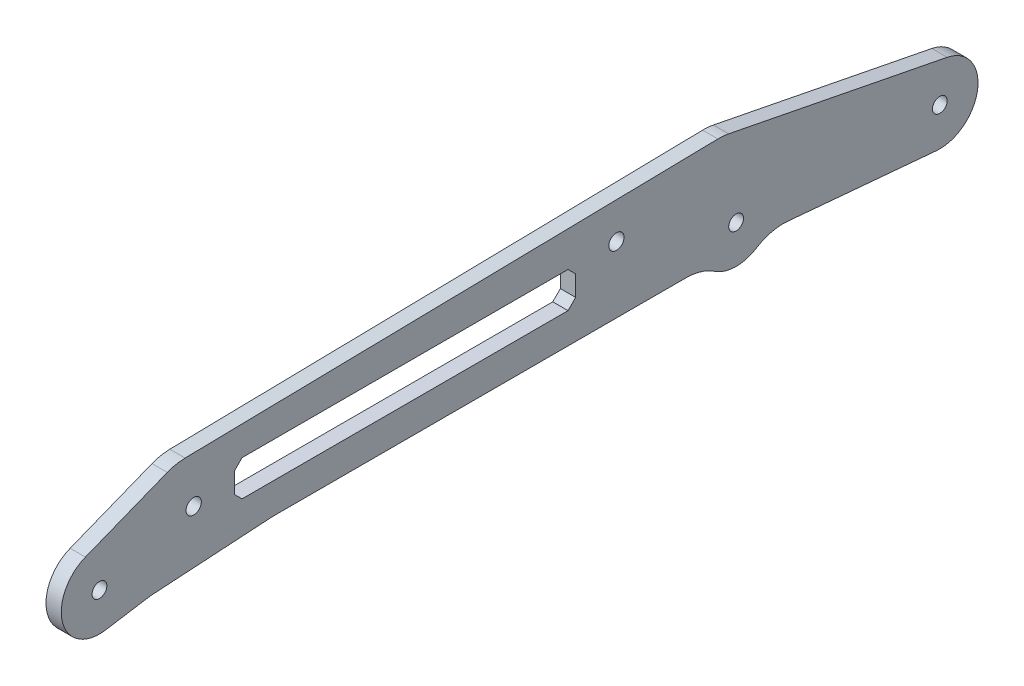
ISO-10303-21;
HEADER;
FILE_DESCRIPTION(('STEP AP214'),'2;1');
FILE_NAME('part.step','',(''),(''),'','','');
FILE_SCHEMA(('AUTOMOTIVE_DESIGN { 1 0 10303 214 1 1 1 1 }'));
ENDSEC;
DATA;
#1=APPLICATION_CONTEXT('core data for automotive mechanical design processes');
#2=APPLICATION_PROTOCOL_DEFINITION('international standard','automotive_design',2000,#1);
#3=PRODUCT_CONTEXT('',#1,'mechanical');
#4=PRODUCT('Part','Part','',(#3));
#5=PRODUCT_RELATED_PRODUCT_CATEGORY('part','',(#4));
#6=PRODUCT_DEFINITION_FORMATION('','',#4);
#7=PRODUCT_DEFINITION_CONTEXT('part definition',#1,'design');
#8=PRODUCT_DEFINITION('design','',#6,#7);
#9=PRODUCT_DEFINITION_SHAPE('','',#8);
#10=(LENGTH_UNIT() NAMED_UNIT(*) SI_UNIT(.MILLI.,.METRE.));
#11=(NAMED_UNIT(*) PLANE_ANGLE_UNIT() SI_UNIT($,.RADIAN.));
#12=(NAMED_UNIT(*) SI_UNIT($,.STERADIAN.) SOLID_ANGLE_UNIT());
#13=UNCERTAINTY_MEASURE_WITH_UNIT(LENGTH_MEASURE(1.E-05),#10,'distance_accuracy_value','');
#14=(GEOMETRIC_REPRESENTATION_CONTEXT(3) GLOBAL_UNCERTAINTY_ASSIGNED_CONTEXT((#13)) GLOBAL_UNIT_ASSIGNED_CONTEXT((#10,
#11,#12)) REPRESENTATION_CONTEXT('',''));
#15=CARTESIAN_POINT('',(0.,0.,0.));
#16=DIRECTION('',(0.,0.,1.));
#17=DIRECTION('',(1.,0.,0.));
#18=AXIS2_PLACEMENT_3D('',#15,#16,#17);
#19=CARTESIAN_POINT('',(1.5,1.49999999999999,0.));
#20=DIRECTION('',(0.,-1.,0.));
#21=DIRECTION('',(0.,0.,-1.));
#22=AXIS2_PLACEMENT_3D('',#19,#20,#21);
#23=PLANE('',#22);
#24=DIRECTION('',(0.,0.,1.));
#25=VECTOR('',#24,1.);
#26=CARTESIAN_POINT('',(-1.5,1.49999999999999,0.));
#27=LINE('',#26,#25);
#28=CARTESIAN_POINT('',(-1.5,1.49999999999999,33.));
#29=VERTEX_POINT('',#28);
#30=CARTESIAN_POINT('',(-1.5,1.49999999999998,97.));
#31=VERTEX_POINT('',#30);
#32=EDGE_CURVE('E370',#29,#31,#27,.T.);
#33=ORIENTED_EDGE('',*,*,#32,.T.);
#34=DIRECTION('',(-1.,0.,0.));
#35=VECTOR('',#34,1.);
#36=CARTESIAN_POINT('',(1.5,1.49999999999998,97.));
#37=LINE('',#36,#35);
#38=CARTESIAN_POINT('',(1.5,1.49999999999998,97.));
#39=VERTEX_POINT('',#38);
#40=EDGE_CURVE('E234',#39,#31,#37,.T.);
#41=ORIENTED_EDGE('',*,*,#40,.F.);
#42=DIRECTION('',(0.,0.,1.));
#43=VECTOR('',#42,1.);
#44=CARTESIAN_POINT('',(1.5,1.49999999999999,0.));
#45=LINE('',#44,#43);
#46=CARTESIAN_POINT('',(1.5,1.49999999999999,33.));
#47=VERTEX_POINT('',#46);
#48=EDGE_CURVE('E314',#47,#39,#45,.T.);
#49=ORIENTED_EDGE('',*,*,#48,.F.);
#50=DIRECTION('',(-1.,0.,0.));
#51=VECTOR('',#50,1.);
#52=CARTESIAN_POINT('',(1.5,1.49999999999999,33.));
#53=LINE('',#52,#51);
#54=EDGE_CURVE('E221',#47,#29,#53,.T.);
#55=ORIENTED_EDGE('',*,*,#54,.T.);
#56=EDGE_LOOP('',(#33,#41,#49,#55));
#57=FACE_BOUND('',#56,.T.);
#58=ADVANCED_FACE('F35',(#57),#23,.F.);
#59=CARTESIAN_POINT('',(1.5,-47.75,47.75));
#60=DIRECTION('',(0.,-0.707106781186548,0.707106781186547));
#61=DIRECTION('',(0.,-0.707106781186547,-0.707106781186548));
#62=AXIS2_PLACEMENT_3D('',#59,#60,#61);
#63=PLANE('',#62);
#64=DIRECTION('',(0.,0.707106781186547,0.707106781186548));
#65=VECTOR('',#64,1.);
#66=CARTESIAN_POINT('',(-1.5,-47.75,47.75));
#67=LINE('',#66,#65);
#68=CARTESIAN_POINT('',(-1.5,2.99999999999998,98.5));
#69=VERTEX_POINT('',#68);
#70=EDGE_CURVE('E373',#31,#69,#67,.T.);
#71=ORIENTED_EDGE('',*,*,#70,.T.);
#72=DIRECTION('',(-1.,0.,0.));
#73=VECTOR('',#72,1.);
#74=CARTESIAN_POINT('',(1.5,2.99999999999998,98.5));
#75=LINE('',#74,#73);
#76=CARTESIAN_POINT('',(1.5,2.99999999999998,98.5));
#77=VERTEX_POINT('',#76);
#78=EDGE_CURVE('E408',#77,#69,#75,.T.);
#79=ORIENTED_EDGE('',*,*,#78,.F.);
#80=DIRECTION('',(0.,0.707106781186547,0.707106781186548));
#81=VECTOR('',#80,1.);
#82=CARTESIAN_POINT('',(1.5,-47.75,47.75));
#83=LINE('',#82,#81);
#84=EDGE_CURVE('E317',#39,#77,#83,.T.);
#85=ORIENTED_EDGE('',*,*,#84,.F.);
#86=ORIENTED_EDGE('',*,*,#40,.T.);
#87=EDGE_LOOP('',(#71,#79,#85,#86));
#88=FACE_BOUND('',#87,.T.);
#89=ADVANCED_FACE('F458',(#88),#63,.F.);
#90=CARTESIAN_POINT('',(1.5,0.,98.5));
#91=DIRECTION('',(0.,0.,-1.));
#92=DIRECTION('',(-1.,0.,0.));
#93=AXIS2_PLACEMENT_3D('',#90,#91,#92);
#94=PLANE('',#93);
#95=DIRECTION('',(0.,-1.,0.));
#96=VECTOR('',#95,1.);
#97=CARTESIAN_POINT('',(-1.5,0.,98.5));
#98=LINE('',#97,#96);
#99=CARTESIAN_POINT('',(-1.5,6.99999999999998,98.5));
#100=VERTEX_POINT('',#99);
#101=EDGE_CURVE('E376',#100,#69,#98,.T.);
#102=ORIENTED_EDGE('',*,*,#101,.F.);
#103=DIRECTION('',(-1.,0.,0.));
#104=VECTOR('',#103,1.);
#105=CARTESIAN_POINT('',(1.5,6.99999999999998,98.5));
#106=LINE('',#105,#104);
#107=CARTESIAN_POINT('',(1.5,6.99999999999998,98.5));
#108=VERTEX_POINT('',#107);
#109=EDGE_CURVE('E406',#108,#100,#106,.T.);
#110=ORIENTED_EDGE('',*,*,#109,.F.);
#111=DIRECTION('',(0.,-1.,0.));
#112=VECTOR('',#111,1.);
#113=CARTESIAN_POINT('',(1.5,0.,98.5));
#114=LINE('',#113,#112);
#115=EDGE_CURVE('E319',#108,#77,#114,.T.);
#116=ORIENTED_EDGE('',*,*,#115,.T.);
#117=ORIENTED_EDGE('',*,*,#78,.T.);
#118=EDGE_LOOP('',(#102,#110,#116,#117));
#119=FACE_BOUND('',#118,.T.);
#120=ADVANCED_FACE('F464',(#119),#94,.T.);
#121=CARTESIAN_POINT('',(1.5,52.75,52.75));
#122=DIRECTION('',(0.,-0.707106781186548,-0.707106781186547));
#123=DIRECTION('',(0.,0.707106781186547,-0.707106781186548));
#124=AXIS2_PLACEMENT_3D('',#121,#122,#123);
#125=PLANE('',#124);
#126=DIRECTION('',(0.,-0.707106781186547,0.707106781186548));
#127=VECTOR('',#126,1.);
#128=CARTESIAN_POINT('',(-1.5,52.75,52.75));
#129=LINE('',#128,#127);
#130=CARTESIAN_POINT('',(-1.5,8.49999999999998,97.));
#131=VERTEX_POINT('',#130);
#132=EDGE_CURVE('E379',#131,#100,#129,.T.);
#133=ORIENTED_EDGE('',*,*,#132,.F.);
#134=DIRECTION('',(-1.,0.,0.));
#135=VECTOR('',#134,1.);
#136=CARTESIAN_POINT('',(1.5,8.49999999999998,97.));
#137=LINE('',#136,#135);
#138=CARTESIAN_POINT('',(1.5,8.49999999999998,97.));
#139=VERTEX_POINT('',#138);
#140=EDGE_CURVE('E404',#139,#131,#137,.T.);
#141=ORIENTED_EDGE('',*,*,#140,.F.);
#142=DIRECTION('',(0.,-0.707106781186547,0.707106781186548));
#143=VECTOR('',#142,1.);
#144=CARTESIAN_POINT('',(1.5,52.75,52.75));
#145=LINE('',#144,#143);
#146=EDGE_CURVE('E322',#139,#108,#145,.T.);
#147=ORIENTED_EDGE('',*,*,#146,.T.);
#148=ORIENTED_EDGE('',*,*,#109,.T.);
#149=EDGE_LOOP('',(#133,#141,#147,#148));
#150=FACE_BOUND('',#149,.T.);
#151=ADVANCED_FACE('F559',(#150),#125,.T.);
#152=CARTESIAN_POINT('',(1.5,8.49999999999999,0.));
#153=DIRECTION('',(0.,-1.,0.));
#154=DIRECTION('',(0.,0.,-1.));
#155=AXIS2_PLACEMENT_3D('',#152,#153,#154);
#156=PLANE('',#155);
#157=DIRECTION('',(0.,0.,1.));
#158=VECTOR('',#157,1.);
#159=CARTESIAN_POINT('',(-1.5,8.49999999999999,0.));
#160=LINE('',#159,#158);
#161=CARTESIAN_POINT('',(-1.5,8.49999999999999,33.));
#162=VERTEX_POINT('',#161);
#163=EDGE_CURVE('E382',#162,#131,#160,.T.);
#164=ORIENTED_EDGE('',*,*,#163,.F.);
#165=DIRECTION('',(-1.,0.,0.));
#166=VECTOR('',#165,1.);
#167=CARTESIAN_POINT('',(1.5,8.49999999999999,33.));
#168=LINE('',#167,#166);
#169=CARTESIAN_POINT('',(1.5,8.49999999999999,33.));
#170=VERTEX_POINT('',#169);
#171=EDGE_CURVE('E402',#170,#162,#168,.T.);
#172=ORIENTED_EDGE('',*,*,#171,.F.);
#173=DIRECTION('',(0.,0.,1.));
#174=VECTOR('',#173,1.);
#175=CARTESIAN_POINT('',(1.5,8.49999999999999,0.));
#176=LINE('',#175,#174);
#177=EDGE_CURVE('E325',#170,#139,#176,.T.);
#178=ORIENTED_EDGE('',*,*,#177,.T.);
#179=ORIENTED_EDGE('',*,*,#140,.T.);
#180=EDGE_LOOP('',(#164,#172,#178,#179));
#181=FACE_BOUND('',#180,.T.);
#182=ADVANCED_FACE('F555',(#181),#156,.T.);
#183=CARTESIAN_POINT('',(1.5,-12.25,12.25));
#184=DIRECTION('',(0.,-0.707106781186548,0.707106781186547));
#185=DIRECTION('',(0.,-0.707106781186547,-0.707106781186548));
#186=AXIS2_PLACEMENT_3D('',#183,#184,#185);
#187=PLANE('',#186);
#188=DIRECTION('',(0.,0.707106781186547,0.707106781186548));
#189=VECTOR('',#188,1.);
#190=CARTESIAN_POINT('',(-1.5,-12.25,12.25));
#191=LINE('',#190,#189);
#192=CARTESIAN_POINT('',(-1.5,6.99999999999999,31.5));
#193=VERTEX_POINT('',#192);
#194=EDGE_CURVE('E385',#193,#162,#191,.T.);
#195=ORIENTED_EDGE('',*,*,#194,.F.);
#196=DIRECTION('',(-1.,0.,0.));
#197=VECTOR('',#196,1.);
#198=CARTESIAN_POINT('',(1.5,6.99999999999999,31.5));
#199=LINE('',#198,#197);
#200=CARTESIAN_POINT('',(1.5,6.99999999999999,31.5));
#201=VERTEX_POINT('',#200);
#202=EDGE_CURVE('E400',#201,#193,#199,.T.);
#203=ORIENTED_EDGE('',*,*,#202,.F.);
#204=DIRECTION('',(0.,0.707106781186547,0.707106781186548));
#205=VECTOR('',#204,1.);
#206=CARTESIAN_POINT('',(1.5,-12.25,12.25));
#207=LINE('',#206,#205);
#208=EDGE_CURVE('E328',#201,#170,#207,.T.);
#209=ORIENTED_EDGE('',*,*,#208,.T.);
#210=ORIENTED_EDGE('',*,*,#171,.T.);
#211=EDGE_LOOP('',(#195,#203,#209,#210));
#212=FACE_BOUND('',#211,.T.);
#213=ADVANCED_FACE('F551',(#212),#187,.T.);
#214=CARTESIAN_POINT('',(1.5,0.,31.5));
#215=DIRECTION('',(0.,0.,-1.));
#216=DIRECTION('',(-1.,0.,0.));
#217=AXIS2_PLACEMENT_3D('',#214,#215,#216);
#218=PLANE('',#217);
#219=DIRECTION('',(0.,-1.,0.));
#220=VECTOR('',#219,1.);
#221=CARTESIAN_POINT('',(-1.5,0.,31.5));
#222=LINE('',#221,#220);
#223=CARTESIAN_POINT('',(-1.5,2.99999999999999,31.5));
#224=VERTEX_POINT('',#223);
#225=EDGE_CURVE('E388',#193,#224,#222,.T.);
#226=ORIENTED_EDGE('',*,*,#225,.T.);
#227=DIRECTION('',(-1.,0.,0.));
#228=VECTOR('',#227,1.);
#229=CARTESIAN_POINT('',(1.5,2.99999999999999,31.5));
#230=LINE('',#229,#228);
#231=CARTESIAN_POINT('',(1.5,2.99999999999999,31.5));
#232=VERTEX_POINT('',#231);
#233=EDGE_CURVE('E225',#232,#224,#230,.T.);
#234=ORIENTED_EDGE('',*,*,#233,.F.);
#235=DIRECTION('',(0.,-1.,0.));
#236=VECTOR('',#235,1.);
#237=CARTESIAN_POINT('',(1.5,0.,31.5));
#238=LINE('',#237,#236);
#239=EDGE_CURVE('E331',#201,#232,#238,.T.);
#240=ORIENTED_EDGE('',*,*,#239,.F.);
#241=ORIENTED_EDGE('',*,*,#202,.T.);
#242=EDGE_LOOP('',(#226,#234,#240,#241));
#243=FACE_BOUND('',#242,.T.);
#244=ADVANCED_FACE('F502',(#243),#218,.F.);
#245=CARTESIAN_POINT('',(1.5,0.,-40.));
#246=DIRECTION('',(-1.,0.,0.));
#247=DIRECTION('',(0.,0.,1.));
#248=AXIS2_PLACEMENT_3D('',#245,#246,#247);
#249=CYLINDRICAL_SURFACE('',#248,7.5);
#250=CARTESIAN_POINT('',(-1.5,0.,-40.));
#251=DIRECTION('',(1.,0.,0.));
#252=DIRECTION('',(0.,0.,-1.));
#253=AXIS2_PLACEMENT_3D('',#250,#251,#252);
#254=CIRCLE('',#253,7.5);
#255=CARTESIAN_POINT('',(-1.5,-7.47039937993417,-39.3343175649913));
#256=VERTEX_POINT('',#255);
#257=CARTESIAN_POINT('',(-1.5,7.35909794826338,-41.4469545216992));
#258=VERTEX_POINT('',#257);
#259=EDGE_CURVE('E220',#256,#258,#254,.T.);
#260=ORIENTED_EDGE('',*,*,#259,.T.);
#261=DIRECTION('',(-1.,0.,0.));
#262=VECTOR('',#261,1.);
#263=CARTESIAN_POINT('',(1.5,7.35909794826338,-41.4469545216992));
#264=LINE('',#263,#262);
#265=CARTESIAN_POINT('',(1.5,7.35909794826338,-41.4469545216992));
#266=VERTEX_POINT('',#265);
#267=EDGE_CURVE('E203',#266,#258,#264,.T.);
#268=ORIENTED_EDGE('',*,*,#267,.F.);
#269=CARTESIAN_POINT('',(1.5,0.,-40.));
#270=DIRECTION('',(1.,0.,0.));
#271=DIRECTION('',(0.,0.,-1.));
#272=AXIS2_PLACEMENT_3D('',#269,#270,#271);
#273=CIRCLE('',#272,7.5);
#274=CARTESIAN_POINT('',(1.5,-7.47039937993417,-39.3343175649913));
#275=VERTEX_POINT('',#274);
#276=EDGE_CURVE('E209',#275,#266,#273,.T.);
#277=ORIENTED_EDGE('',*,*,#276,.F.);
#278=DIRECTION('',(-1.,0.,0.));
#279=VECTOR('',#278,1.);
#280=CARTESIAN_POINT('',(1.5,-7.47039937993417,-39.3343175649913));
#281=LINE('',#280,#279);
#282=EDGE_CURVE('E341',#275,#256,#281,.T.);
#283=ORIENTED_EDGE('',*,*,#282,.T.);
#284=EDGE_LOOP('',(#260,#268,#277,#283));
#285=FACE_BOUND('',#284,.T.);
#286=ADVANCED_FACE('F218',(#285),#249,.T.);
#287=CARTESIAN_POINT('',(1.5,14.9312082073686,-2.9357917752925));
#288=DIRECTION('',(0.,0.981213059768451,-0.192927269559888));
#289=DIRECTION('',(0.,0.192927269559888,0.981213059768452));
#290=AXIS2_PLACEMENT_3D('',#287,#288,#289);
#291=PLANE('',#290);
#292=DIRECTION('',(0.,-0.192927269559888,-0.981213059768451));
#293=VECTOR('',#292,1.);
#294=CARTESIAN_POINT('',(-1.5,14.9312082073686,-2.9357917752925));
#295=LINE('',#294,#293);
#296=CARTESIAN_POINT('',(-1.5,15.7939988386428,1.45229414529));
#297=VERTEX_POINT('',#296);
#298=EDGE_CURVE('E346',#297,#258,#295,.T.);
#299=ORIENTED_EDGE('',*,*,#298,.F.);
#300=DIRECTION('',(-1.,0.,0.));
#301=VECTOR('',#300,1.);
#302=CARTESIAN_POINT('',(1.5,15.7939988386428,1.45229414529));
#303=LINE('',#302,#301);
#304=CARTESIAN_POINT('',(1.5,15.7939988386428,1.45229414529));
#305=VERTEX_POINT('',#304);
#306=EDGE_CURVE('E206',#297,#305,#303,.F.);
#307=ORIENTED_EDGE('',*,*,#306,.T.);
#308=DIRECTION('',(0.,-0.192927269559888,-0.981213059768451));
#309=VECTOR('',#308,1.);
#310=CARTESIAN_POINT('',(1.5,14.9312082073686,-2.9357917752925));
#311=LINE('',#310,#309);
#312=EDGE_CURVE('E198',#305,#266,#311,.T.);
#313=ORIENTED_EDGE('',*,*,#312,.T.);
#314=ORIENTED_EDGE('',*,*,#267,.T.);
#315=EDGE_LOOP('',(#299,#307,#313,#314));
#316=FACE_BOUND('',#315,.T.);
#317=ADVANCED_FACE('F201',(#316),#291,.T.);
#318=CARTESIAN_POINT('',(1.5,16.040959321814,0.298436452498867));
#319=DIRECTION('',(0.,0.999826978392632,0.0186014321561421));
#320=DIRECTION('',(0.,-0.0186014321561421,0.999826978392632));
#321=AXIS2_PLACEMENT_3D('',#318,#319,#320);
#322=PLANE('',#321);
#323=DIRECTION('',(0.,0.0186014321561421,-0.999826978392632));
#324=VECTOR('',#323,1.);
#325=CARTESIAN_POINT('',(1.5,16.040959321814,0.298436452498867));
#326=LINE('',#325,#324);
#327=CARTESIAN_POINT('',(1.5,14.0336689941836,108.190291562629));
#328=VERTEX_POINT('',#327);
#329=CARTESIAN_POINT('',(1.5,15.9801380248846,3.56758116245029));
#330=VERTEX_POINT('',#329);
#331=EDGE_CURVE('E208',#328,#330,#326,.T.);
#332=ORIENTED_EDGE('',*,*,#331,.T.);
#333=DIRECTION('',(-1.,0.,0.));
#334=VECTOR('',#333,1.);
#335=CARTESIAN_POINT('',(1.5,15.9801380248846,3.56758116245029));
#336=LINE('',#335,#334);
#337=CARTESIAN_POINT('',(-1.5,15.9801380248846,3.56758116245029));
#338=VERTEX_POINT('',#337);
#339=EDGE_CURVE('E246',#330,#338,#336,.T.);
#340=ORIENTED_EDGE('',*,*,#339,.T.);
#341=DIRECTION('',(0.,0.0186014321561421,-0.999826978392632));
#342=VECTOR('',#341,1.);
#343=CARTESIAN_POINT('',(-1.5,16.040959321814,0.298436452498867));
#344=LINE('',#343,#342);
#345=CARTESIAN_POINT('',(-1.5,14.0336689941836,108.190291562629));
#346=VERTEX_POINT('',#345);
#347=EDGE_CURVE('E348',#346,#338,#344,.T.);
#348=ORIENTED_EDGE('',*,*,#347,.F.);
#349=DIRECTION('',(-1.,0.,0.));
#350=VECTOR('',#349,1.);
#351=CARTESIAN_POINT('',(1.5,14.0336689941836,108.190291562629));
#352=LINE('',#351,#350);
#353=EDGE_CURVE('E244',#346,#328,#352,.F.);
#354=ORIENTED_EDGE('',*,*,#353,.T.);
#355=EDGE_LOOP('',(#332,#340,#348,#354));
#356=FACE_BOUND('',#355,.T.);
#357=ADVANCED_FACE('F438',(#356),#322,.T.);
#358=CARTESIAN_POINT('',(1.5,49.7343916487453,19.6761869214032));
#359=DIRECTION('',(0.,0.929872776298727,0.367881257878812));
#360=DIRECTION('',(0.,-0.367881257878812,0.929872776298727));
#361=AXIS2_PLACEMENT_3D('',#358,#359,#360);
#362=PLANE('',#361);
#363=DIRECTION('',(0.,0.367881257878812,-0.929872776298727));
#364=VECTOR('',#363,1.);
#365=CARTESIAN_POINT('',(1.5,49.7343916487453,19.6761869214032));
#366=LINE('',#365,#364);
#367=CARTESIAN_POINT('',(1.5,6.97404582224044,127.759109434091));
#368=VERTEX_POINT('',#367);
#369=CARTESIAN_POINT('',(1.5,13.3341269732446,111.683089819856));
#370=VERTEX_POINT('',#369);
#371=EDGE_CURVE('E431',#368,#370,#366,.T.);
#372=ORIENTED_EDGE('',*,*,#371,.T.);
#373=DIRECTION('',(-1.,0.,0.));
#374=VECTOR('',#373,1.);
#375=CARTESIAN_POINT('',(1.5,13.3341269732446,111.683089819855));
#376=LINE('',#375,#374);
#377=CARTESIAN_POINT('',(-1.5,13.3341269732446,111.683089819856));
#378=VERTEX_POINT('',#377);
#379=EDGE_CURVE('E265',#370,#378,#376,.T.);
#380=ORIENTED_EDGE('',*,*,#379,.T.);
#381=DIRECTION('',(0.,0.367881257878812,-0.929872776298727));
#382=VECTOR('',#381,1.);
#383=CARTESIAN_POINT('',(-1.5,49.7343916487453,19.6761869214032));
#384=LINE('',#383,#382);
#385=CARTESIAN_POINT('',(-1.5,6.97404582224044,127.759109434091));
#386=VERTEX_POINT('',#385);
#387=EDGE_CURVE('E350',#386,#378,#384,.T.);
#388=ORIENTED_EDGE('',*,*,#387,.F.);
#389=DIRECTION('',(-1.,0.,0.));
#390=VECTOR('',#389,1.);
#391=CARTESIAN_POINT('',(1.5,6.97404582224044,127.759109434091));
#392=LINE('',#391,#390);
#393=EDGE_CURVE('E222',#368,#386,#392,.T.);
#394=ORIENTED_EDGE('',*,*,#393,.F.);
#395=EDGE_LOOP('',(#372,#380,#388,#394));
#396=FACE_BOUND('',#395,.T.);
#397=ADVANCED_FACE('F428',(#396),#362,.T.);
#398=CARTESIAN_POINT('',(1.5,0.,125.));
#399=DIRECTION('',(-1.,0.,0.));
#400=DIRECTION('',(0.,0.,1.));
#401=AXIS2_PLACEMENT_3D('',#398,#399,#400);
#402=CYLINDRICAL_SURFACE('',#401,7.50000000000001);
#403=CARTESIAN_POINT('',(-1.5,0.,125.));
#404=DIRECTION('',(1.,0.,0.));
#405=DIRECTION('',(0.,0.,-1.));
#406=AXIS2_PLACEMENT_3D('',#403,#404,#405);
#407=CIRCLE('',#406,7.50000000000001);
#408=CARTESIAN_POINT('',(-1.5,-7.40640747228635,123.818844483372));
#409=VERTEX_POINT('',#408);
#410=EDGE_CURVE('E353',#386,#409,#407,.T.);
#411=ORIENTED_EDGE('',*,*,#410,.T.);
#412=DIRECTION('',(-1.,0.,0.));
#413=VECTOR('',#412,1.);
#414=CARTESIAN_POINT('',(1.5,-7.40640747228635,123.818844483372));
#415=LINE('',#414,#413);
#416=CARTESIAN_POINT('',(1.5,-7.40640747228635,123.818844483372));
#417=VERTEX_POINT('',#416);
#418=EDGE_CURVE('E227',#417,#409,#415,.T.);
#419=ORIENTED_EDGE('',*,*,#418,.F.);
#420=CARTESIAN_POINT('',(1.5,0.,125.));
#421=DIRECTION('',(1.,0.,0.));
#422=DIRECTION('',(0.,0.,-1.));
#423=AXIS2_PLACEMENT_3D('',#420,#421,#422);
#424=CIRCLE('',#423,7.50000000000001);
#425=EDGE_CURVE('E522',#368,#417,#424,.T.);
#426=ORIENTED_EDGE('',*,*,#425,.F.);
#427=ORIENTED_EDGE('',*,*,#393,.T.);
#428=EDGE_LOOP('',(#411,#419,#426,#427));
#429=FACE_BOUND('',#428,.T.);
#430=ADVANCED_FACE('F424',(#429),#402,.T.);
#431=CARTESIAN_POINT('',(1.5,12.0338570705745,1.91912971550789));
#432=DIRECTION('',(0.,-0.987520996304844,-0.157487402217094));
#433=DIRECTION('',(0.,0.157487402217094,-0.987520996304844));
#434=AXIS2_PLACEMENT_3D('',#431,#432,#433);
#435=PLANE('',#434);
#436=DIRECTION('',(0.,-0.157487402217094,0.987520996304844));
#437=VECTOR('',#436,1.);
#438=CARTESIAN_POINT('',(-1.5,12.0338570705745,1.91912971550789));
#439=LINE('',#438,#437);
#440=CARTESIAN_POINT('',(-1.5,-6.07543657815531,115.473023262617));
#441=VERTEX_POINT('',#440);
#442=EDGE_CURVE('E356',#441,#409,#439,.T.);
#443=ORIENTED_EDGE('',*,*,#442,.F.);
#444=DIRECTION('',(-1.,0.,0.));
#445=VECTOR('',#444,1.);
#446=CARTESIAN_POINT('',(1.5,-6.0754365781553,115.473023262617));
#447=LINE('',#446,#445);
#448=CARTESIAN_POINT('',(1.5,-6.07543657815531,115.473023262617));
#449=VERTEX_POINT('',#448);
#450=EDGE_CURVE('E242',#441,#449,#447,.F.);
#451=ORIENTED_EDGE('',*,*,#450,.T.);
#452=DIRECTION('',(0.,-0.157487402217094,0.987520996304844));
#453=VECTOR('',#452,1.);
#454=CARTESIAN_POINT('',(1.5,12.0338570705745,1.91912971550789));
#455=LINE('',#454,#453);
#456=EDGE_CURVE('E419',#449,#417,#455,.T.);
#457=ORIENTED_EDGE('',*,*,#456,.T.);
#458=ORIENTED_EDGE('',*,*,#418,.T.);
#459=EDGE_LOOP('',(#443,#451,#457,#458));
#460=FACE_BOUND('',#459,.T.);
#461=ADVANCED_FACE('F416',(#460),#435,.T.);
#462=CARTESIAN_POINT('',(1.5,1.18287937743191,0.0739299610894947));
#463=DIRECTION('',(0.,0.998052578482889,0.0623782861551807));
#464=DIRECTION('',(0.,-0.0623782861551807,0.998052578482889));
#465=AXIS2_PLACEMENT_3D('',#462,#463,#464);
#466=PLANE('',#465);
#467=DIRECTION('',(0.,0.0623782861551807,-0.998052578482889));
#468=VECTOR('',#467,1.);
#469=CARTESIAN_POINT('',(-1.5,1.18287937743191,0.0739299610894947));
#470=LINE('',#469,#468);
#471=CARTESIAN_POINT('',(-1.5,-5.97012075637486,114.521932101997));
#472=VERTEX_POINT('',#471);
#473=CARTESIAN_POINT('',(-1.5,-4.51947421517113,91.3115874427379));
#474=VERTEX_POINT('',#473);
#475=EDGE_CURVE('E295',#472,#474,#470,.T.);
#476=ORIENTED_EDGE('',*,*,#475,.T.);
#477=DIRECTION('',(-1.,0.,0.));
#478=VECTOR('',#477,1.);
#479=CARTESIAN_POINT('',(1.5,-4.51947421517113,91.3115874427378));
#480=LINE('',#479,#478);
#481=CARTESIAN_POINT('',(1.5,-4.51947421517113,91.3115874427379));
#482=VERTEX_POINT('',#481);
#483=EDGE_CURVE('E240',#474,#482,#480,.F.);
#484=ORIENTED_EDGE('',*,*,#483,.T.);
#485=DIRECTION('',(0.,0.0623782861551807,-0.998052578482889));
#486=VECTOR('',#485,1.);
#487=CARTESIAN_POINT('',(1.5,1.18287937743191,0.0739299610894947));
#488=LINE('',#487,#486);
#489=CARTESIAN_POINT('',(1.5,-5.97012075637486,114.521932101997));
#490=VERTEX_POINT('',#489);
#491=EDGE_CURVE('E305',#490,#482,#488,.T.);
#492=ORIENTED_EDGE('',*,*,#491,.F.);
#493=DIRECTION('',(-1.,0.,0.));
#494=VECTOR('',#493,1.);
#495=CARTESIAN_POINT('',(1.5,-5.97012075637485,114.521932101997));
#496=LINE('',#495,#494);
#497=EDGE_CURVE('E237',#490,#472,#496,.T.);
#498=ORIENTED_EDGE('',*,*,#497,.T.);
#499=EDGE_LOOP('',(#476,#484,#492,#498));
#500=FACE_BOUND('',#499,.T.);
#501=ADVANCED_FACE('F486',(#500),#466,.F.);
#502=CARTESIAN_POINT('',(1.5,-4.50000000000001,0.));
#503=DIRECTION('',(0.,1.,0.));
#504=DIRECTION('',(0.,0.,1.));
#505=AXIS2_PLACEMENT_3D('',#502,#503,#504);
#506=PLANE('',#505);
#507=DIRECTION('',(0.,0.,-1.));
#508=VECTOR('',#507,1.);
#509=CARTESIAN_POINT('',(1.5,-4.50000000000001,0.));
#510=LINE('',#509,#508);
#511=CARTESIAN_POINT('',(1.5,-4.50000000000001,90.687804581186));
#512=VERTEX_POINT('',#511);
#513=CARTESIAN_POINT('',(1.5,-4.50000000000001,9.7979589711327));
#514=VERTEX_POINT('',#513);
#515=EDGE_CURVE('E300',#512,#514,#510,.T.);
#516=ORIENTED_EDGE('',*,*,#515,.F.);
#517=DIRECTION('',(-1.,0.,0.));
#518=VECTOR('',#517,1.);
#519=CARTESIAN_POINT('',(-1.5,-4.50000000000001,90.687804581186));
#520=LINE('',#519,#518);
#521=CARTESIAN_POINT('',(-1.5,-4.50000000000001,90.687804581186));
#522=VERTEX_POINT('',#521);
#523=EDGE_CURVE('E233',#512,#522,#520,.T.);
#524=ORIENTED_EDGE('',*,*,#523,.T.);
#525=DIRECTION('',(0.,0.,-1.));
#526=VECTOR('',#525,1.);
#527=CARTESIAN_POINT('',(-1.5,-4.50000000000001,0.));
#528=LINE('',#527,#526);
#529=CARTESIAN_POINT('',(-1.5,-4.50000000000001,9.7979589711327));
#530=VERTEX_POINT('',#529);
#531=EDGE_CURVE('E285',#522,#530,#528,.T.);
#532=ORIENTED_EDGE('',*,*,#531,.T.);
#533=DIRECTION('',(1.,0.,0.));
#534=VECTOR('',#533,1.);
#535=CARTESIAN_POINT('',(1.5,-4.50000000000001,9.7979589711327));
#536=LINE('',#535,#534);
#537=EDGE_CURVE('E231',#530,#514,#536,.T.);
#538=ORIENTED_EDGE('',*,*,#537,.T.);
#539=EDGE_LOOP('',(#516,#524,#532,#538));
#540=FACE_BOUND('',#539,.T.);
#541=ADVANCED_FACE('F292',(#540),#506,.F.);
#542=CARTESIAN_POINT('',(1.5,0.,0.));
#543=DIRECTION('',(-1.,0.,0.));
#544=DIRECTION('',(0.,0.,1.));
#545=AXIS2_PLACEMENT_3D('',#542,#543,#544);
#546=CYLINDRICAL_SURFACE('',#545,7.5);
#547=CARTESIAN_POINT('',(-1.5,0.,0.));
#548=DIRECTION('',(1.,0.,0.));
#549=DIRECTION('',(0.,0.,-1.));
#550=AXIS2_PLACEMENT_3D('',#547,#548,#549);
#551=CIRCLE('',#550,7.5);
#552=CARTESIAN_POINT('',(-1.5,-6.21428571428572,4.19912527334258));
#553=VERTEX_POINT('',#552);
#554=CARTESIAN_POINT('',(-1.5,-6.35679302105677,-3.98009830122875));
#555=VERTEX_POINT('',#554);
#556=EDGE_CURVE('E286',#553,#555,#551,.T.);
#557=ORIENTED_EDGE('',*,*,#556,.T.);
#558=DIRECTION('',(-1.,0.,0.));
#559=VECTOR('',#558,1.);
#560=CARTESIAN_POINT('',(1.5,-6.35679302105677,-3.98009830122875));
#561=LINE('',#560,#559);
#562=CARTESIAN_POINT('',(1.5,-6.35679302105677,-3.98009830122875));
#563=VERTEX_POINT('',#562);
#564=EDGE_CURVE('E58',#555,#563,#561,.F.);
#565=ORIENTED_EDGE('',*,*,#564,.T.);
#566=CARTESIAN_POINT('',(1.5,0.,0.));
#567=DIRECTION('',(1.,0.,0.));
#568=DIRECTION('',(0.,0.,-1.));
#569=AXIS2_PLACEMENT_3D('',#566,#567,#568);
#570=CIRCLE('',#569,7.5);
#571=CARTESIAN_POINT('',(1.5,-6.21428571428572,4.19912527334258));
#572=VERTEX_POINT('',#571);
#573=EDGE_CURVE('E299',#572,#563,#570,.T.);
#574=ORIENTED_EDGE('',*,*,#573,.F.);
#575=DIRECTION('',(-1.,0.,0.));
#576=VECTOR('',#575,1.);
#577=CARTESIAN_POINT('',(1.5,-6.21428571428572,4.19912527334258));
#578=LINE('',#577,#576);
#579=EDGE_CURVE('E261',#572,#553,#578,.T.);
#580=ORIENTED_EDGE('',*,*,#579,.T.);
#581=EDGE_LOOP('',(#557,#565,#574,#580));
#582=FACE_BOUND('',#581,.T.);
#583=ADVANCED_FACE('F301',(#582),#546,.T.);
#584=CARTESIAN_POINT('',(1.5,0.,0.));
#585=DIRECTION('',(-1.,0.,0.));
#586=DIRECTION('',(0.,0.,1.));
#587=AXIS2_PLACEMENT_3D('',#584,#585,#586);
#588=CYLINDRICAL_SURFACE('',#587,1.45);
#589=CARTESIAN_POINT('',(1.5,0.,0.));
#590=DIRECTION('',(1.,0.,0.));
#591=DIRECTION('',(0.,0.,-1.));
#592=AXIS2_PLACEMENT_3D('',#589,#590,#591);
#593=CIRCLE('',#592,1.45);
#594=CARTESIAN_POINT('',(1.5,0.,-1.45));
#595=VERTEX_POINT('',#594);
#596=EDGE_CURVE('E335',#595,#595,#593,.T.);
#597=ORIENTED_EDGE('',*,*,#596,.T.);
#598=EDGE_LOOP('',(#597));
#599=FACE_BOUND('',#598,.T.);
#600=CARTESIAN_POINT('',(-1.5,0.,0.));
#601=DIRECTION('',(1.,0.,0.));
#602=DIRECTION('',(0.,0.,-1.));
#603=AXIS2_PLACEMENT_3D('',#600,#601,#602);
#604=CIRCLE('',#603,1.45);
#605=CARTESIAN_POINT('',(-1.5,0.,-1.45));
#606=VERTEX_POINT('',#605);
#607=EDGE_CURVE('E392',#606,#606,#604,.T.);
#608=ORIENTED_EDGE('',*,*,#607,.F.);
#609=EDGE_LOOP('',(#608));
#610=FACE_BOUND('',#609,.T.);
#611=ADVANCED_FACE('F483',(#599,#610),#588,.F.);
#612=CARTESIAN_POINT('',(1.5,17.25,17.25));
#613=DIRECTION('',(0.,-0.707106781186548,-0.707106781186547));
#614=DIRECTION('',(0.,0.707106781186547,-0.707106781186548));
#615=AXIS2_PLACEMENT_3D('',#612,#613,#614);
#616=PLANE('',#615);
#617=DIRECTION('',(0.,-0.707106781186547,0.707106781186548));
#618=VECTOR('',#617,1.);
#619=CARTESIAN_POINT('',(-1.5,17.25,17.25));
#620=LINE('',#619,#618);
#621=EDGE_CURVE('E390',#224,#29,#620,.T.);
#622=ORIENTED_EDGE('',*,*,#621,.T.);
#623=ORIENTED_EDGE('',*,*,#54,.F.);
#624=DIRECTION('',(0.,-0.707106781186547,0.707106781186548));
#625=VECTOR('',#624,1.);
#626=CARTESIAN_POINT('',(1.5,17.25,17.25));
#627=LINE('',#626,#625);
#628=EDGE_CURVE('E333',#232,#47,#627,.T.);
#629=ORIENTED_EDGE('',*,*,#628,.F.);
#630=ORIENTED_EDGE('',*,*,#233,.T.);
#631=EDGE_LOOP('',(#622,#623,#629,#630));
#632=FACE_BOUND('',#631,.T.);
#633=ADVANCED_FACE('F473',(#632),#616,.F.);
#634=CARTESIAN_POINT('',(1.5,4.99999999999999,106.5));
#635=DIRECTION('',(-1.,0.,0.));
#636=DIRECTION('',(0.,0.,1.));
#637=AXIS2_PLACEMENT_3D('',#634,#635,#636);
#638=CYLINDRICAL_SURFACE('',#637,1.5);
#639=CARTESIAN_POINT('',(1.5,4.99999999999999,106.5));
#640=DIRECTION('',(1.,0.,0.));
#641=DIRECTION('',(0.,0.,-1.));
#642=AXIS2_PLACEMENT_3D('',#639,#640,#641);
#643=CIRCLE('',#642,1.5);
#644=CARTESIAN_POINT('',(1.5,4.99999999999999,105.));
#645=VERTEX_POINT('',#644);
#646=EDGE_CURVE('E311',#645,#645,#643,.T.);
#647=ORIENTED_EDGE('',*,*,#646,.T.);
#648=EDGE_LOOP('',(#647));
#649=FACE_BOUND('',#648,.T.);
#650=CARTESIAN_POINT('',(-1.5,4.99999999999999,106.5));
#651=DIRECTION('',(1.,0.,0.));
#652=DIRECTION('',(0.,0.,-1.));
#653=AXIS2_PLACEMENT_3D('',#650,#651,#652);
#654=CIRCLE('',#653,1.5);
#655=CARTESIAN_POINT('',(-1.5,4.99999999999999,105.));
#656=VERTEX_POINT('',#655);
#657=EDGE_CURVE('E367',#656,#656,#654,.T.);
#658=ORIENTED_EDGE('',*,*,#657,.F.);
#659=EDGE_LOOP('',(#658));
#660=FACE_BOUND('',#659,.T.);
#661=ADVANCED_FACE('F469',(#649,#660),#638,.F.);
#662=CARTESIAN_POINT('',(1.5,8.5,23.5));
#663=DIRECTION('',(-1.,0.,0.));
#664=DIRECTION('',(0.,0.,1.));
#665=AXIS2_PLACEMENT_3D('',#662,#663,#664);
#666=CYLINDRICAL_SURFACE('',#665,1.5);
#667=CARTESIAN_POINT('',(1.5,8.5,23.5));
#668=DIRECTION('',(1.,0.,0.));
#669=DIRECTION('',(0.,0.,-1.));
#670=AXIS2_PLACEMENT_3D('',#667,#668,#669);
#671=CIRCLE('',#670,1.5);
#672=CARTESIAN_POINT('',(1.5,8.5,22.));
#673=VERTEX_POINT('',#672);
#674=EDGE_CURVE('E303',#673,#673,#671,.T.);
#675=ORIENTED_EDGE('',*,*,#674,.T.);
#676=EDGE_LOOP('',(#675));
#677=FACE_BOUND('',#676,.T.);
#678=CARTESIAN_POINT('',(-1.5,8.5,23.5));
#679=DIRECTION('',(1.,0.,0.));
#680=DIRECTION('',(0.,0.,-1.));
#681=AXIS2_PLACEMENT_3D('',#678,#679,#680);
#682=CIRCLE('',#681,1.5);
#683=CARTESIAN_POINT('',(-1.5,8.5,22.));
#684=VERTEX_POINT('',#683);
#685=EDGE_CURVE('E364',#684,#684,#682,.T.);
#686=ORIENTED_EDGE('',*,*,#685,.F.);
#687=EDGE_LOOP('',(#686));
#688=FACE_BOUND('',#687,.T.);
#689=ADVANCED_FACE('F472',(#677,#688),#666,.F.);
#690=CARTESIAN_POINT('',(1.5,-3.93410522902064,0.350565560854665));
#691=DIRECTION('',(0.,-0.99605325065789,0.0887576580011616));
#692=DIRECTION('',(0.,-0.0887576580011616,-0.99605325065789));
#693=AXIS2_PLACEMENT_3D('',#690,#691,#692);
#694=PLANE('',#693);
#695=DIRECTION('',(0.,0.0887576580011616,0.99605325065789));
#696=VECTOR('',#695,1.);
#697=CARTESIAN_POINT('',(1.5,-3.93410522902064,0.350565560854665));
#698=LINE('',#697,#696);
#699=CARTESIAN_POINT('',(1.5,-4.87198454255356,-10.174472616212));
#700=VERTEX_POINT('',#699);
#701=EDGE_CURVE('E214',#275,#700,#698,.T.);
#702=ORIENTED_EDGE('',*,*,#701,.T.);
#703=DIRECTION('',(-1.,0.,0.));
#704=VECTOR('',#703,1.);
#705=CARTESIAN_POINT('',(1.5,-4.87198454255356,-10.174472616212));
#706=LINE('',#705,#704);
#707=CARTESIAN_POINT('',(-1.5,-4.87198454255356,-10.174472616212));
#708=VERTEX_POINT('',#707);
#709=EDGE_CURVE('E258',#700,#708,#706,.T.);
#710=ORIENTED_EDGE('',*,*,#709,.T.);
#711=DIRECTION('',(0.,0.0887576580011616,0.99605325065789));
#712=VECTOR('',#711,1.);
#713=CARTESIAN_POINT('',(-1.5,-3.93410522902064,0.350565560854665));
#714=LINE('',#713,#712);
#715=EDGE_CURVE('E361',#256,#708,#714,.T.);
#716=ORIENTED_EDGE('',*,*,#715,.F.);
#717=ORIENTED_EDGE('',*,*,#282,.F.);
#718=EDGE_LOOP('',(#702,#710,#716,#717));
#719=FACE_BOUND('',#718,.T.);
#720=ADVANCED_FACE('F445',(#719),#694,.T.);
#721=CARTESIAN_POINT('',(1.5,0.,-40.));
#722=DIRECTION('',(-1.,0.,0.));
#723=DIRECTION('',(0.,0.,1.));
#724=AXIS2_PLACEMENT_3D('',#721,#722,#723);
#725=CYLINDRICAL_SURFACE('',#724,1.45);
#726=CARTESIAN_POINT('',(1.5,0.,-40.));
#727=DIRECTION('',(1.,0.,0.));
#728=DIRECTION('',(0.,0.,-1.));
#729=AXIS2_PLACEMENT_3D('',#726,#727,#728);
#730=CIRCLE('',#729,1.45);
#731=CARTESIAN_POINT('',(1.5,0.,-41.45));
#732=VERTEX_POINT('',#731);
#733=EDGE_CURVE('E216',#732,#732,#730,.T.);
#734=ORIENTED_EDGE('',*,*,#733,.T.);
#735=EDGE_LOOP('',(#734));
#736=FACE_BOUND('',#735,.T.);
#737=CARTESIAN_POINT('',(-1.5,0.,-40.));
#738=DIRECTION('',(1.,0.,0.));
#739=DIRECTION('',(0.,0.,-1.));
#740=AXIS2_PLACEMENT_3D('',#737,#738,#739);
#741=CIRCLE('',#740,1.45);
#742=CARTESIAN_POINT('',(-1.5,0.,-41.45));
#743=VERTEX_POINT('',#742);
#744=EDGE_CURVE('E342',#743,#743,#741,.T.);
#745=ORIENTED_EDGE('',*,*,#744,.F.);
#746=EDGE_LOOP('',(#745));
#747=FACE_BOUND('',#746,.T.);
#748=ADVANCED_FACE('F480',(#736,#747),#725,.F.);
#749=CARTESIAN_POINT('',(1.5,0.,125.));
#750=DIRECTION('',(-1.,0.,0.));
#751=DIRECTION('',(0.,0.,1.));
#752=AXIS2_PLACEMENT_3D('',#749,#750,#751);
#753=CYLINDRICAL_SURFACE('',#752,1.45);
#754=CARTESIAN_POINT('',(1.5,0.,125.));
#755=DIRECTION('',(1.,0.,0.));
#756=DIRECTION('',(0.,0.,-1.));
#757=AXIS2_PLACEMENT_3D('',#754,#755,#756);
#758=CIRCLE('',#757,1.45);
#759=CARTESIAN_POINT('',(1.5,0.,123.55));
#760=VERTEX_POINT('',#759);
#761=EDGE_CURVE('E338',#760,#760,#758,.T.);
#762=ORIENTED_EDGE('',*,*,#761,.T.);
#763=EDGE_LOOP('',(#762));
#764=FACE_BOUND('',#763,.T.);
#765=CARTESIAN_POINT('',(-1.5,0.,125.));
#766=DIRECTION('',(1.,0.,0.));
#767=DIRECTION('',(0.,0.,-1.));
#768=AXIS2_PLACEMENT_3D('',#765,#766,#767);
#769=CIRCLE('',#768,1.45);
#770=CARTESIAN_POINT('',(-1.5,0.,123.55));
#771=VERTEX_POINT('',#770);
#772=EDGE_CURVE('E395',#771,#771,#769,.T.);
#773=ORIENTED_EDGE('',*,*,#772,.F.);
#774=EDGE_LOOP('',(#773));
#775=FACE_BOUND('',#774,.T.);
#776=ADVANCED_FACE('F505',(#764,#775),#753,.F.);
#777=CARTESIAN_POINT('',(1.5,0.,0.));
#778=DIRECTION('',(1.,0.,0.));
#779=DIRECTION('',(0.,0.,-1.));
#780=AXIS2_PLACEMENT_3D('',#777,#778,#779);
#781=PLANE('',#780);
#782=ORIENTED_EDGE('',*,*,#733,.F.);
#783=EDGE_LOOP('',(#782));
#784=FACE_BOUND('',#783,.T.);
#785=ORIENTED_EDGE('',*,*,#312,.F.);
#786=CARTESIAN_POINT('',(1.5,5.98186824095833,3.38156684088887));
#787=DIRECTION('',(1.,0.,0.));
#788=DIRECTION('',(0.,0.,-1.));
#789=AXIS2_PLACEMENT_3D('',#786,#787,#788);
#790=CIRCLE('',#789,10.);
#791=EDGE_CURVE('E256',#305,#330,#790,.T.);
#792=ORIENTED_EDGE('',*,*,#791,.T.);
#793=ORIENTED_EDGE('',*,*,#331,.F.);
#794=CARTESIAN_POINT('',(1.5,4.03539921025731,108.004277241067));
#795=DIRECTION('',(1.,0.,0.));
#796=DIRECTION('',(0.,0.,-1.));
#797=AXIS2_PLACEMENT_3D('',#794,#795,#796);
#798=CIRCLE('',#797,10.);
#799=EDGE_CURVE('E254',#328,#370,#798,.T.);
#800=ORIENTED_EDGE('',*,*,#799,.T.);
#801=ORIENTED_EDGE('',*,*,#371,.F.);
#802=ORIENTED_EDGE('',*,*,#425,.T.);
#803=ORIENTED_EDGE('',*,*,#456,.F.);
#804=CARTESIAN_POINT('',(1.5,-15.9506465412037,113.898149240446));
#805=DIRECTION('',(1.,0.,0.));
#806=DIRECTION('',(0.,0.,-1.));
#807=AXIS2_PLACEMENT_3D('',#804,#805,#806);
#808=CIRCLE('',#807,10.);
#809=EDGE_CURVE('E274',#449,#490,#808,.F.);
#810=ORIENTED_EDGE('',*,*,#809,.T.);
#811=ORIENTED_EDGE('',*,*,#491,.T.);
#812=CARTESIAN_POINT('',(1.5,-14.5,90.687804581186));
#813=DIRECTION('',(1.,0.,0.));
#814=DIRECTION('',(0.,0.,-1.));
#815=AXIS2_PLACEMENT_3D('',#812,#813,#814);
#816=CIRCLE('',#815,10.);
#817=EDGE_CURVE('E270',#482,#512,#816,.F.);
#818=ORIENTED_EDGE('',*,*,#817,.T.);
#819=ORIENTED_EDGE('',*,*,#515,.T.);
#820=CARTESIAN_POINT('',(1.5,-14.5,9.7979589711327));
#821=DIRECTION('',(1.,0.,0.));
#822=DIRECTION('',(0.,0.,-1.));
#823=AXIS2_PLACEMENT_3D('',#820,#821,#822);
#824=CIRCLE('',#823,10.);
#825=EDGE_CURVE('E11',#514,#572,#824,.F.);
#826=ORIENTED_EDGE('',*,*,#825,.T.);
#827=ORIENTED_EDGE('',*,*,#573,.T.);
#828=CARTESIAN_POINT('',(1.5,-14.8325170491325,-9.28689603620042));
#829=DIRECTION('',(1.,0.,0.));
#830=DIRECTION('',(0.,0.,-1.));
#831=AXIS2_PLACEMENT_3D('',#828,#829,#830);
#832=CIRCLE('',#831,10.);
#833=EDGE_CURVE('E50',#563,#700,#832,.F.);
#834=ORIENTED_EDGE('',*,*,#833,.T.);
#835=ORIENTED_EDGE('',*,*,#701,.F.);
#836=ORIENTED_EDGE('',*,*,#276,.T.);
#837=EDGE_LOOP('',(#785,#792,#793,#800,#801,#802,#803,#810,#811,#818,#819,#826,#827,#834,#835,#836));
#838=FACE_BOUND('',#837,.T.);
#839=ORIENTED_EDGE('',*,*,#674,.F.);
#840=EDGE_LOOP('',(#839));
#841=FACE_BOUND('',#840,.T.);
#842=ORIENTED_EDGE('',*,*,#646,.F.);
#843=EDGE_LOOP('',(#842));
#844=FACE_BOUND('',#843,.T.);
#845=ORIENTED_EDGE('',*,*,#48,.T.);
#846=ORIENTED_EDGE('',*,*,#84,.T.);
#847=ORIENTED_EDGE('',*,*,#115,.F.);
#848=ORIENTED_EDGE('',*,*,#146,.F.);
#849=ORIENTED_EDGE('',*,*,#177,.F.);
#850=ORIENTED_EDGE('',*,*,#208,.F.);
#851=ORIENTED_EDGE('',*,*,#239,.T.);
#852=ORIENTED_EDGE('',*,*,#628,.T.);
#853=EDGE_LOOP('',(#845,#846,#847,#848,#849,#850,#851,#852));
#854=FACE_BOUND('',#853,.T.);
#855=ORIENTED_EDGE('',*,*,#596,.F.);
#856=EDGE_LOOP('',(#855));
#857=FACE_BOUND('',#856,.T.);
#858=ORIENTED_EDGE('',*,*,#761,.F.);
#859=EDGE_LOOP('',(#858));
#860=FACE_BOUND('',#859,.T.);
#861=ADVANCED_FACE('F212',(#784,#838,#841,#844,#854,#857,#860),#781,.T.);
#862=CARTESIAN_POINT('',(-1.5,0.,0.));
#863=DIRECTION('',(1.,0.,0.));
#864=DIRECTION('',(0.,0.,-1.));
#865=AXIS2_PLACEMENT_3D('',#862,#863,#864);
#866=PLANE('',#865);
#867=ORIENTED_EDGE('',*,*,#744,.T.);
#868=EDGE_LOOP('',(#867));
#869=FACE_BOUND('',#868,.T.);
#870=ORIENTED_EDGE('',*,*,#347,.T.);
#871=CARTESIAN_POINT('',(-1.5,5.98186824095833,3.38156684088887));
#872=DIRECTION('',(1.,0.,0.));
#873=DIRECTION('',(0.,0.,-1.));
#874=AXIS2_PLACEMENT_3D('',#871,#872,#873);
#875=CIRCLE('',#874,10.);
#876=EDGE_CURVE('E251',#338,#297,#875,.F.);
#877=ORIENTED_EDGE('',*,*,#876,.T.);
#878=ORIENTED_EDGE('',*,*,#298,.T.);
#879=ORIENTED_EDGE('',*,*,#259,.F.);
#880=ORIENTED_EDGE('',*,*,#715,.T.);
#881=CARTESIAN_POINT('',(-1.5,-14.8325170491325,-9.28689603620042));
#882=DIRECTION('',(1.,0.,0.));
#883=DIRECTION('',(0.,0.,-1.));
#884=AXIS2_PLACEMENT_3D('',#881,#882,#883);
#885=CIRCLE('',#884,10.);
#886=EDGE_CURVE('E276',#708,#555,#885,.T.);
#887=ORIENTED_EDGE('',*,*,#886,.T.);
#888=ORIENTED_EDGE('',*,*,#556,.F.);
#889=CARTESIAN_POINT('',(-1.5,-14.5,9.7979589711327));
#890=DIRECTION('',(1.,0.,0.));
#891=DIRECTION('',(0.,0.,-1.));
#892=AXIS2_PLACEMENT_3D('',#889,#890,#891);
#893=CIRCLE('',#892,10.);
#894=EDGE_CURVE('E43',#553,#530,#893,.T.);
#895=ORIENTED_EDGE('',*,*,#894,.T.);
#896=ORIENTED_EDGE('',*,*,#531,.F.);
#897=CARTESIAN_POINT('',(-1.5,-14.5,90.687804581186));
#898=DIRECTION('',(1.,0.,0.));
#899=DIRECTION('',(0.,0.,-1.));
#900=AXIS2_PLACEMENT_3D('',#897,#898,#899);
#901=CIRCLE('',#900,10.);
#902=EDGE_CURVE('E268',#522,#474,#901,.T.);
#903=ORIENTED_EDGE('',*,*,#902,.T.);
#904=ORIENTED_EDGE('',*,*,#475,.F.);
#905=CARTESIAN_POINT('',(-1.5,-15.9506465412037,113.898149240446));
#906=DIRECTION('',(1.,0.,0.));
#907=DIRECTION('',(0.,0.,-1.));
#908=AXIS2_PLACEMENT_3D('',#905,#906,#907);
#909=CIRCLE('',#908,10.);
#910=EDGE_CURVE('E272',#472,#441,#909,.T.);
#911=ORIENTED_EDGE('',*,*,#910,.T.);
#912=ORIENTED_EDGE('',*,*,#442,.T.);
#913=ORIENTED_EDGE('',*,*,#410,.F.);
#914=ORIENTED_EDGE('',*,*,#387,.T.);
#915=CARTESIAN_POINT('',(-1.5,4.03539921025731,108.004277241067));
#916=DIRECTION('',(1.,0.,0.));
#917=DIRECTION('',(0.,0.,-1.));
#918=AXIS2_PLACEMENT_3D('',#915,#916,#917);
#919=CIRCLE('',#918,10.);
#920=EDGE_CURVE('E249',#378,#346,#919,.F.);
#921=ORIENTED_EDGE('',*,*,#920,.T.);
#922=EDGE_LOOP('',(#870,#877,#878,#879,#880,#887,#888,#895,#896,#903,#904,#911,#912,#913,#914,#921));
#923=FACE_BOUND('',#922,.T.);
#924=ORIENTED_EDGE('',*,*,#685,.T.);
#925=EDGE_LOOP('',(#924));
#926=FACE_BOUND('',#925,.T.);
#927=ORIENTED_EDGE('',*,*,#657,.T.);
#928=EDGE_LOOP('',(#927));
#929=FACE_BOUND('',#928,.T.);
#930=ORIENTED_EDGE('',*,*,#32,.F.);
#931=ORIENTED_EDGE('',*,*,#621,.F.);
#932=ORIENTED_EDGE('',*,*,#225,.F.);
#933=ORIENTED_EDGE('',*,*,#194,.T.);
#934=ORIENTED_EDGE('',*,*,#163,.T.);
#935=ORIENTED_EDGE('',*,*,#132,.T.);
#936=ORIENTED_EDGE('',*,*,#101,.T.);
#937=ORIENTED_EDGE('',*,*,#70,.F.);
#938=EDGE_LOOP('',(#930,#931,#932,#933,#934,#935,#936,#937));
#939=FACE_BOUND('',#938,.T.);
#940=ORIENTED_EDGE('',*,*,#607,.T.);
#941=EDGE_LOOP('',(#940));
#942=FACE_BOUND('',#941,.T.);
#943=ORIENTED_EDGE('',*,*,#772,.T.);
#944=EDGE_LOOP('',(#943));
#945=FACE_BOUND('',#944,.T.);
#946=ADVANCED_FACE('F283',(#869,#923,#926,#929,#939,#942,#945),#866,.F.);
#947=CARTESIAN_POINT('',(1.5,-14.5,90.687804581186));
#948=DIRECTION('',(1.,0.,0.));
#949=DIRECTION('',(0.,0.,-1.));
#950=AXIS2_PLACEMENT_3D('',#947,#948,#949);
#951=CYLINDRICAL_SURFACE('',#950,10.);
#952=ORIENTED_EDGE('',*,*,#817,.F.);
#953=ORIENTED_EDGE('',*,*,#483,.F.);
#954=ORIENTED_EDGE('',*,*,#902,.F.);
#955=ORIENTED_EDGE('',*,*,#523,.F.);
#956=EDGE_LOOP('',(#952,#953,#954,#955));
#957=FACE_BOUND('',#956,.T.);
#958=ADVANCED_FACE('F507',(#957),#951,.F.);
#959=CARTESIAN_POINT('',(1.5,-15.9506465412037,113.898149240446));
#960=DIRECTION('',(-1.,0.,0.));
#961=DIRECTION('',(0.,0.,1.));
#962=AXIS2_PLACEMENT_3D('',#959,#960,#961);
#963=CYLINDRICAL_SURFACE('',#962,10.);
#964=ORIENTED_EDGE('',*,*,#809,.F.);
#965=ORIENTED_EDGE('',*,*,#450,.F.);
#966=ORIENTED_EDGE('',*,*,#910,.F.);
#967=ORIENTED_EDGE('',*,*,#497,.F.);
#968=EDGE_LOOP('',(#964,#965,#966,#967));
#969=FACE_BOUND('',#968,.T.);
#970=ADVANCED_FACE('F455',(#969),#963,.F.);
#971=CARTESIAN_POINT('',(1.5,5.98186824095833,3.38156684088887));
#972=DIRECTION('',(-1.,0.,0.));
#973=DIRECTION('',(0.,0.,1.));
#974=AXIS2_PLACEMENT_3D('',#971,#972,#973);
#975=CYLINDRICAL_SURFACE('',#974,10.);
#976=ORIENTED_EDGE('',*,*,#791,.F.);
#977=ORIENTED_EDGE('',*,*,#306,.F.);
#978=ORIENTED_EDGE('',*,*,#876,.F.);
#979=ORIENTED_EDGE('',*,*,#339,.F.);
#980=EDGE_LOOP('',(#976,#977,#978,#979));
#981=FACE_BOUND('',#980,.T.);
#982=ADVANCED_FACE('F442',(#981),#975,.T.);
#983=CARTESIAN_POINT('',(1.5,-14.8325170491325,-9.28689603620042));
#984=DIRECTION('',(-1.,0.,0.));
#985=DIRECTION('',(0.,0.,1.));
#986=AXIS2_PLACEMENT_3D('',#983,#984,#985);
#987=CYLINDRICAL_SURFACE('',#986,10.);
#988=ORIENTED_EDGE('',*,*,#833,.F.);
#989=ORIENTED_EDGE('',*,*,#564,.F.);
#990=ORIENTED_EDGE('',*,*,#886,.F.);
#991=ORIENTED_EDGE('',*,*,#709,.F.);
#992=EDGE_LOOP('',(#988,#989,#990,#991));
#993=FACE_BOUND('',#992,.T.);
#994=ADVANCED_FACE('F448',(#993),#987,.F.);
#995=CARTESIAN_POINT('',(1.5,-14.5,9.7979589711327));
#996=DIRECTION('',(-1.,0.,0.));
#997=DIRECTION('',(0.,0.,1.));
#998=AXIS2_PLACEMENT_3D('',#995,#996,#997);
#999=CYLINDRICAL_SURFACE('',#998,10.);
#1000=ORIENTED_EDGE('',*,*,#825,.F.);
#1001=ORIENTED_EDGE('',*,*,#537,.F.);
#1002=ORIENTED_EDGE('',*,*,#894,.F.);
#1003=ORIENTED_EDGE('',*,*,#579,.F.);
#1004=EDGE_LOOP('',(#1000,#1001,#1002,#1003));
#1005=FACE_BOUND('',#1004,.T.);
#1006=ADVANCED_FACE('F298',(#1005),#999,.F.);
#1007=CARTESIAN_POINT('',(1.5,4.03539921025731,108.004277241067));
#1008=DIRECTION('',(-1.,0.,0.));
#1009=DIRECTION('',(0.,0.,1.));
#1010=AXIS2_PLACEMENT_3D('',#1007,#1008,#1009);
#1011=CYLINDRICAL_SURFACE('',#1010,10.);
#1012=ORIENTED_EDGE('',*,*,#799,.F.);
#1013=ORIENTED_EDGE('',*,*,#353,.F.);
#1014=ORIENTED_EDGE('',*,*,#920,.F.);
#1015=ORIENTED_EDGE('',*,*,#379,.F.);
#1016=EDGE_LOOP('',(#1012,#1013,#1014,#1015));
#1017=FACE_BOUND('',#1016,.T.);
#1018=ADVANCED_FACE('F37',(#1017),#1011,.T.);
#1019=CLOSED_SHELL('',(#58,#89,#120,#151,#182,#213,#244,#286,#317,#357,#397,#430,#461,#501,#541,
#583,#611,#633,#661,#689,#720,#748,#776,#861,#946,#958,#970,#982,#994,#1006,#1018));
#1020=MANIFOLD_SOLID_BREP('B2',#1019);
#1021=ADVANCED_BREP_SHAPE_REPRESENTATION('',(#18,#1020),#14);
#1022=SHAPE_DEFINITION_REPRESENTATION(#9,#1021);
ENDSEC;
END-ISO-10303-21;
